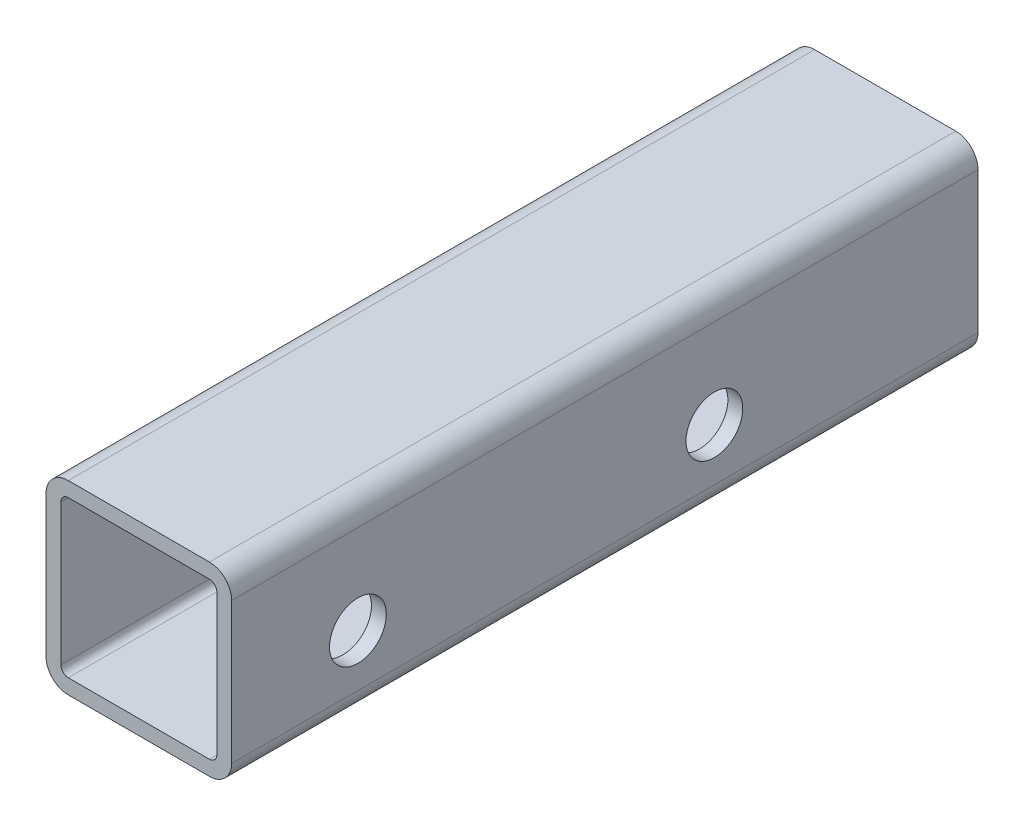
ISO-10303-21;
HEADER;
FILE_DESCRIPTION(('STEP AP214'),'2;1');
FILE_NAME('part.step','',(''),(''),'','','');
FILE_SCHEMA(('AUTOMOTIVE_DESIGN { 1 0 10303 214 1 1 1 1 }'));
ENDSEC;
DATA;
#1=APPLICATION_CONTEXT('core data for automotive mechanical design processes');
#2=APPLICATION_PROTOCOL_DEFINITION('international standard','automotive_design',2000,#1);
#3=PRODUCT_CONTEXT('',#1,'mechanical');
#4=PRODUCT('Part','Part','',(#3));
#5=PRODUCT_RELATED_PRODUCT_CATEGORY('part','',(#4));
#6=PRODUCT_DEFINITION_FORMATION('','',#4);
#7=PRODUCT_DEFINITION_CONTEXT('part definition',#1,'design');
#8=PRODUCT_DEFINITION('design','',#6,#7);
#9=PRODUCT_DEFINITION_SHAPE('','',#8);
#10=(LENGTH_UNIT() NAMED_UNIT(*) SI_UNIT(.MILLI.,.METRE.));
#11=(NAMED_UNIT(*) PLANE_ANGLE_UNIT() SI_UNIT($,.RADIAN.));
#12=(NAMED_UNIT(*) SI_UNIT($,.STERADIAN.) SOLID_ANGLE_UNIT());
#13=UNCERTAINTY_MEASURE_WITH_UNIT(LENGTH_MEASURE(1.E-05),#10,'distance_accuracy_value','');
#14=(GEOMETRIC_REPRESENTATION_CONTEXT(3) GLOBAL_UNCERTAINTY_ASSIGNED_CONTEXT((#13)) GLOBAL_UNIT_ASSIGNED_CONTEXT((#10,
#11,#12)) REPRESENTATION_CONTEXT('',''));
#15=CARTESIAN_POINT('',(0.,0.,0.));
#16=DIRECTION('',(0.,0.,1.));
#17=DIRECTION('',(1.,0.,0.));
#18=AXIS2_PLACEMENT_3D('',#15,#16,#17);
#19=CARTESIAN_POINT('',(-8.28226376370367E-12,-9.52127265918534E-12,100.500000000007));
#20=DIRECTION('',(0.,0.,1.));
#21=DIRECTION('',(0.,-1.,0.));
#22=AXIS2_PLACEMENT_3D('',#19,#20,#21);
#23=PLANE('',#22);
#24=DIRECTION('',(0.,1.,0.));
#25=VECTOR('',#24,1.);
#26=CARTESIAN_POINT('',(-12.5000000000083,-4.75000000000968,100.500000000007));
#27=LINE('',#26,#25);
#28=CARTESIAN_POINT('',(-12.5000000000083,-9.50000000000962,100.500000000007));
#29=VERTEX_POINT('',#28);
#30=CARTESIAN_POINT('',(-12.5000000000083,9.49999999999037,100.500000000007));
#31=VERTEX_POINT('',#30);
#32=EDGE_CURVE('E258',#29,#31,#27,.T.);
#33=ORIENTED_EDGE('',*,*,#32,.F.);
#34=CARTESIAN_POINT('',(-9.50000000000828,-9.50000000000955,100.500000000007));
#35=DIRECTION('',(0.,0.,-1.));
#36=DIRECTION('',(1.,0.,0.));
#37=AXIS2_PLACEMENT_3D('',#34,#35,#36);
#38=CIRCLE('',#37,3.);
#39=CARTESIAN_POINT('',(-9.50000000000827,-12.5000000000095,100.500000000007));
#40=VERTEX_POINT('',#39);
#41=EDGE_CURVE('E274',#40,#29,#38,.T.);
#42=ORIENTED_EDGE('',*,*,#41,.F.);
#43=DIRECTION('',(-1.,0.,0.));
#44=VECTOR('',#43,1.);
#45=CARTESIAN_POINT('',(4.74999999999172,-12.5000000000096,100.500000000007));
#46=LINE('',#45,#44);
#47=CARTESIAN_POINT('',(9.49999999999172,-12.5000000000095,100.500000000007));
#48=VERTEX_POINT('',#47);
#49=EDGE_CURVE('E236',#48,#40,#46,.T.);
#50=ORIENTED_EDGE('',*,*,#49,.F.);
#51=CARTESIAN_POINT('',(9.49999999999171,-9.50000000000955,100.500000000007));
#52=DIRECTION('',(0.,0.,-1.));
#53=DIRECTION('',(0.,1.,0.));
#54=AXIS2_PLACEMENT_3D('',#51,#52,#53);
#55=CIRCLE('',#54,3.);
#56=CARTESIAN_POINT('',(12.4999999999917,-9.50000000000955,100.500000000007));
#57=VERTEX_POINT('',#56);
#58=EDGE_CURVE('E299',#57,#48,#55,.T.);
#59=ORIENTED_EDGE('',*,*,#58,.F.);
#60=DIRECTION('',(0.,-1.,0.));
#61=VECTOR('',#60,1.);
#62=CARTESIAN_POINT('',(12.4999999999917,4.74999999999042,100.500000000007));
#63=LINE('',#62,#61);
#64=CARTESIAN_POINT('',(12.4999999999917,9.49999999999044,100.500000000007));
#65=VERTEX_POINT('',#64);
#66=EDGE_CURVE('E249',#65,#57,#63,.T.);
#67=ORIENTED_EDGE('',*,*,#66,.F.);
#68=CARTESIAN_POINT('',(9.49999999999172,9.49999999999051,100.500000000007));
#69=DIRECTION('',(0.,0.,-1.));
#70=DIRECTION('',(-1.,0.,0.));
#71=AXIS2_PLACEMENT_3D('',#68,#69,#70);
#72=CIRCLE('',#71,3.);
#73=CARTESIAN_POINT('',(9.49999999999172,12.4999999999905,100.500000000007));
#74=VERTEX_POINT('',#73);
#75=EDGE_CURVE('E26',#74,#65,#72,.T.);
#76=ORIENTED_EDGE('',*,*,#75,.F.);
#77=DIRECTION('',(1.,0.,0.));
#78=VECTOR('',#77,1.);
#79=CARTESIAN_POINT('',(-4.75000000000828,12.4999999999903,100.500000000007));
#80=LINE('',#79,#78);
#81=CARTESIAN_POINT('',(-9.50000000000828,12.4999999999905,100.500000000007));
#82=VERTEX_POINT('',#81);
#83=EDGE_CURVE('E330',#82,#74,#80,.T.);
#84=ORIENTED_EDGE('',*,*,#83,.F.);
#85=CARTESIAN_POINT('',(-9.50000000000828,9.49999999999051,100.500000000007));
#86=DIRECTION('',(0.,0.,-1.));
#87=DIRECTION('',(0.,-1.,0.));
#88=AXIS2_PLACEMENT_3D('',#85,#86,#87);
#89=CIRCLE('',#88,3.);
#90=EDGE_CURVE('E242',#31,#82,#89,.T.);
#91=ORIENTED_EDGE('',*,*,#90,.F.);
#92=EDGE_LOOP('',(#33,#42,#50,#59,#67,#76,#84,#91));
#93=FACE_BOUND('',#92,.T.);
#94=DIRECTION('',(-1.,0.,0.));
#95=VECTOR('',#94,1.);
#96=CARTESIAN_POINT('',(-4.75000000000828,10.4999999999905,100.500000000007));
#97=LINE('',#96,#95);
#98=CARTESIAN_POINT('',(9.49999999999172,10.4999999999905,100.500000000007));
#99=VERTEX_POINT('',#98);
#100=CARTESIAN_POINT('',(-9.50000000000828,10.4999999999905,100.500000000007));
#101=VERTEX_POINT('',#100);
#102=EDGE_CURVE('E254',#99,#101,#97,.T.);
#103=ORIENTED_EDGE('',*,*,#102,.F.);
#104=CARTESIAN_POINT('',(9.49999999999172,9.49999999999051,100.500000000007));
#105=DIRECTION('',(0.,0.,1.));
#106=DIRECTION('',(-1.,0.,0.));
#107=AXIS2_PLACEMENT_3D('',#104,#105,#106);
#108=CIRCLE('',#107,1.);
#109=CARTESIAN_POINT('',(10.4999999999917,9.49999999999051,100.500000000007));
#110=VERTEX_POINT('',#109);
#111=EDGE_CURVE('E227',#110,#99,#108,.T.);
#112=ORIENTED_EDGE('',*,*,#111,.F.);
#113=DIRECTION('',(0.,1.,0.));
#114=VECTOR('',#113,1.);
#115=CARTESIAN_POINT('',(10.4999999999917,4.74999999999049,100.500000000007));
#116=LINE('',#115,#114);
#117=CARTESIAN_POINT('',(10.4999999999917,-9.50000000000955,100.500000000007));
#118=VERTEX_POINT('',#117);
#119=EDGE_CURVE('E298',#118,#110,#116,.T.);
#120=ORIENTED_EDGE('',*,*,#119,.F.);
#121=CARTESIAN_POINT('',(9.49999999999171,-9.50000000000955,100.500000000007));
#122=DIRECTION('',(0.,0.,1.));
#123=DIRECTION('',(0.,1.,0.));
#124=AXIS2_PLACEMENT_3D('',#121,#122,#123);
#125=CIRCLE('',#124,1.);
#126=CARTESIAN_POINT('',(9.49999999999172,-10.5000000000095,100.500000000007));
#127=VERTEX_POINT('',#126);
#128=EDGE_CURVE('E264',#127,#118,#125,.T.);
#129=ORIENTED_EDGE('',*,*,#128,.F.);
#130=DIRECTION('',(1.,0.,0.));
#131=VECTOR('',#130,1.);
#132=CARTESIAN_POINT('',(4.74999999999172,-10.5000000000096,100.500000000007));
#133=LINE('',#132,#131);
#134=CARTESIAN_POINT('',(-9.50000000000828,-10.5000000000095,100.500000000007));
#135=VERTEX_POINT('',#134);
#136=EDGE_CURVE('E262',#135,#127,#133,.T.);
#137=ORIENTED_EDGE('',*,*,#136,.F.);
#138=CARTESIAN_POINT('',(-9.50000000000828,-9.50000000000955,100.500000000007));
#139=DIRECTION('',(0.,0.,1.));
#140=DIRECTION('',(1.,0.,0.));
#141=AXIS2_PLACEMENT_3D('',#138,#139,#140);
#142=CIRCLE('',#141,1.);
#143=CARTESIAN_POINT('',(-10.5000000000083,-9.50000000000955,100.500000000007));
#144=VERTEX_POINT('',#143);
#145=EDGE_CURVE('E210',#144,#135,#142,.T.);
#146=ORIENTED_EDGE('',*,*,#145,.F.);
#147=DIRECTION('',(0.,-1.,0.));
#148=VECTOR('',#147,1.);
#149=CARTESIAN_POINT('',(-10.5000000000083,-4.75000000000954,100.500000000007));
#150=LINE('',#149,#148);
#151=CARTESIAN_POINT('',(-10.5000000000083,9.49999999999051,100.500000000007));
#152=VERTEX_POINT('',#151);
#153=EDGE_CURVE('E195',#152,#144,#150,.T.);
#154=ORIENTED_EDGE('',*,*,#153,.F.);
#155=CARTESIAN_POINT('',(-9.50000000000828,9.49999999999051,100.500000000007));
#156=DIRECTION('',(0.,0.,1.));
#157=DIRECTION('',(0.,-1.,0.));
#158=AXIS2_PLACEMENT_3D('',#155,#156,#157);
#159=CIRCLE('',#158,1.);
#160=EDGE_CURVE('E307',#101,#152,#159,.T.);
#161=ORIENTED_EDGE('',*,*,#160,.F.);
#162=EDGE_LOOP('',(#103,#112,#120,#129,#137,#146,#154,#161));
#163=FACE_BOUND('',#162,.T.);
#164=ADVANCED_FACE('F16',(#93,#163),#23,.T.);
#165=CARTESIAN_POINT('',(-8.28226376370367E-12,-9.52127265918534E-12,7.38964445190504E-12));
#166=DIRECTION('',(0.,0.,1.));
#167=DIRECTION('',(0.,-1.,0.));
#168=AXIS2_PLACEMENT_3D('',#165,#166,#167);
#169=PLANE('',#168);
#170=DIRECTION('',(0.,1.,0.));
#171=VECTOR('',#170,1.);
#172=CARTESIAN_POINT('',(-12.5000000000083,-4.75000000000968,7.38964445190504E-12));
#173=LINE('',#172,#171);
#174=CARTESIAN_POINT('',(-12.5000000000083,-9.50000000000962,7.38964445190504E-12));
#175=VERTEX_POINT('',#174);
#176=CARTESIAN_POINT('',(-12.5000000000083,9.49999999999037,7.38964445190504E-12));
#177=VERTEX_POINT('',#176);
#178=EDGE_CURVE('E238',#175,#177,#173,.T.);
#179=ORIENTED_EDGE('',*,*,#178,.T.);
#180=CARTESIAN_POINT('',(-9.50000000000828,9.49999999999051,7.38964445190504E-12));
#181=DIRECTION('',(0.,0.,-1.));
#182=DIRECTION('',(0.,-1.,0.));
#183=AXIS2_PLACEMENT_3D('',#180,#181,#182);
#184=CIRCLE('',#183,3.);
#185=CARTESIAN_POINT('',(-9.50000000000828,12.4999999999905,7.38964445190504E-12));
#186=VERTEX_POINT('',#185);
#187=EDGE_CURVE('E289',#177,#186,#184,.T.);
#188=ORIENTED_EDGE('',*,*,#187,.T.);
#189=DIRECTION('',(1.,0.,0.));
#190=VECTOR('',#189,1.);
#191=CARTESIAN_POINT('',(-4.75000000000828,12.4999999999903,7.38964445190504E-12));
#192=LINE('',#191,#190);
#193=CARTESIAN_POINT('',(9.49999999999172,12.4999999999905,7.38964445190504E-12));
#194=VERTEX_POINT('',#193);
#195=EDGE_CURVE('E228',#186,#194,#192,.T.);
#196=ORIENTED_EDGE('',*,*,#195,.T.);
#197=CARTESIAN_POINT('',(9.49999999999172,9.49999999999051,7.38964445190504E-12));
#198=DIRECTION('',(0.,0.,-1.));
#199=DIRECTION('',(-1.,0.,0.));
#200=AXIS2_PLACEMENT_3D('',#197,#198,#199);
#201=CIRCLE('',#200,3.);
#202=CARTESIAN_POINT('',(12.4999999999917,9.49999999999044,7.38964445190504E-12));
#203=VERTEX_POINT('',#202);
#204=EDGE_CURVE('E11',#194,#203,#201,.T.);
#205=ORIENTED_EDGE('',*,*,#204,.T.);
#206=DIRECTION('',(0.,-1.,0.));
#207=VECTOR('',#206,1.);
#208=CARTESIAN_POINT('',(12.4999999999917,4.74999999999042,7.38964445190504E-12));
#209=LINE('',#208,#207);
#210=CARTESIAN_POINT('',(12.4999999999917,-9.50000000000955,7.38964445190504E-12));
#211=VERTEX_POINT('',#210);
#212=EDGE_CURVE('E248',#203,#211,#209,.T.);
#213=ORIENTED_EDGE('',*,*,#212,.T.);
#214=CARTESIAN_POINT('',(9.49999999999171,-9.50000000000955,7.38964445190504E-12));
#215=DIRECTION('',(0.,0.,-1.));
#216=DIRECTION('',(0.,1.,0.));
#217=AXIS2_PLACEMENT_3D('',#214,#215,#216);
#218=CIRCLE('',#217,3.);
#219=CARTESIAN_POINT('',(9.49999999999172,-12.5000000000095,7.38964445190504E-12));
#220=VERTEX_POINT('',#219);
#221=EDGE_CURVE('E232',#211,#220,#218,.T.);
#222=ORIENTED_EDGE('',*,*,#221,.T.);
#223=DIRECTION('',(-1.,0.,0.));
#224=VECTOR('',#223,1.);
#225=CARTESIAN_POINT('',(4.74999999999172,-12.5000000000096,7.38964445190504E-12));
#226=LINE('',#225,#224);
#227=CARTESIAN_POINT('',(-9.50000000000827,-12.5000000000095,7.38964445190504E-12));
#228=VERTEX_POINT('',#227);
#229=EDGE_CURVE('E290',#220,#228,#226,.T.);
#230=ORIENTED_EDGE('',*,*,#229,.T.);
#231=CARTESIAN_POINT('',(-9.50000000000828,-9.50000000000955,7.38964445190504E-12));
#232=DIRECTION('',(0.,0.,-1.));
#233=DIRECTION('',(1.,0.,0.));
#234=AXIS2_PLACEMENT_3D('',#231,#232,#233);
#235=CIRCLE('',#234,3.);
#236=EDGE_CURVE('E273',#228,#175,#235,.T.);
#237=ORIENTED_EDGE('',*,*,#236,.T.);
#238=EDGE_LOOP('',(#179,#188,#196,#205,#213,#222,#230,#237));
#239=FACE_BOUND('',#238,.T.);
#240=DIRECTION('',(-1.,0.,0.));
#241=VECTOR('',#240,1.);
#242=CARTESIAN_POINT('',(-4.75000000000828,10.4999999999905,7.38964445190504E-12));
#243=LINE('',#242,#241);
#244=CARTESIAN_POINT('',(9.49999999999172,10.4999999999905,7.38964445190504E-12));
#245=VERTEX_POINT('',#244);
#246=CARTESIAN_POINT('',(-9.50000000000829,10.4999999999905,7.38964445190504E-12));
#247=VERTEX_POINT('',#246);
#248=EDGE_CURVE('E216',#245,#247,#243,.T.);
#249=ORIENTED_EDGE('',*,*,#248,.T.);
#250=CARTESIAN_POINT('',(-9.50000000000828,9.49999999999051,7.38964445190504E-12));
#251=DIRECTION('',(0.,0.,1.));
#252=DIRECTION('',(0.,-1.,0.));
#253=AXIS2_PLACEMENT_3D('',#250,#251,#252);
#254=CIRCLE('',#253,1.);
#255=CARTESIAN_POINT('',(-10.5000000000083,9.49999999999051,7.38964445190504E-12));
#256=VERTEX_POINT('',#255);
#257=EDGE_CURVE('E190',#247,#256,#254,.T.);
#258=ORIENTED_EDGE('',*,*,#257,.T.);
#259=DIRECTION('',(0.,-1.,0.));
#260=VECTOR('',#259,1.);
#261=CARTESIAN_POINT('',(-10.5000000000083,-4.75000000000954,7.38964445190504E-12));
#262=LINE('',#261,#260);
#263=CARTESIAN_POINT('',(-10.5000000000083,-9.50000000000955,7.38964445190504E-12));
#264=VERTEX_POINT('',#263);
#265=EDGE_CURVE('E182',#256,#264,#262,.T.);
#266=ORIENTED_EDGE('',*,*,#265,.T.);
#267=CARTESIAN_POINT('',(-9.50000000000828,-9.50000000000955,7.38964445190504E-12));
#268=DIRECTION('',(0.,0.,1.));
#269=DIRECTION('',(1.,0.,0.));
#270=AXIS2_PLACEMENT_3D('',#267,#268,#269);
#271=CIRCLE('',#270,1.);
#272=CARTESIAN_POINT('',(-9.50000000000828,-10.5000000000095,7.38964445190504E-12));
#273=VERTEX_POINT('',#272);
#274=EDGE_CURVE('E188',#264,#273,#271,.T.);
#275=ORIENTED_EDGE('',*,*,#274,.T.);
#276=DIRECTION('',(1.,0.,0.));
#277=VECTOR('',#276,1.);
#278=CARTESIAN_POINT('',(4.74999999999172,-10.5000000000096,7.38964445190504E-12));
#279=LINE('',#278,#277);
#280=CARTESIAN_POINT('',(9.49999999999172,-10.5000000000095,7.38964445190504E-12));
#281=VERTEX_POINT('',#280);
#282=EDGE_CURVE('E281',#273,#281,#279,.T.);
#283=ORIENTED_EDGE('',*,*,#282,.T.);
#284=CARTESIAN_POINT('',(9.49999999999171,-9.50000000000955,7.38964445190504E-12));
#285=DIRECTION('',(0.,0.,1.));
#286=DIRECTION('',(0.,1.,0.));
#287=AXIS2_PLACEMENT_3D('',#284,#285,#286);
#288=CIRCLE('',#287,1.);
#289=CARTESIAN_POINT('',(10.4999999999917,-9.50000000000955,7.38964445190504E-12));
#290=VERTEX_POINT('',#289);
#291=EDGE_CURVE('E294',#281,#290,#288,.T.);
#292=ORIENTED_EDGE('',*,*,#291,.T.);
#293=DIRECTION('',(0.,1.,0.));
#294=VECTOR('',#293,1.);
#295=CARTESIAN_POINT('',(10.4999999999917,4.74999999999049,7.38964445190504E-12));
#296=LINE('',#295,#294);
#297=CARTESIAN_POINT('',(10.4999999999917,9.49999999999051,7.38964445190504E-12));
#298=VERTEX_POINT('',#297);
#299=EDGE_CURVE('E322',#290,#298,#296,.T.);
#300=ORIENTED_EDGE('',*,*,#299,.T.);
#301=CARTESIAN_POINT('',(9.49999999999172,9.49999999999051,7.38964445190504E-12));
#302=DIRECTION('',(0.,0.,1.));
#303=DIRECTION('',(-1.,0.,0.));
#304=AXIS2_PLACEMENT_3D('',#301,#302,#303);
#305=CIRCLE('',#304,1.);
#306=EDGE_CURVE('E226',#298,#245,#305,.T.);
#307=ORIENTED_EDGE('',*,*,#306,.T.);
#308=EDGE_LOOP('',(#249,#258,#266,#275,#283,#292,#300,#307));
#309=FACE_BOUND('',#308,.T.);
#310=ADVANCED_FACE('F185',(#239,#309),#169,.F.);
#311=CARTESIAN_POINT('',(9.49999999999172,9.49999999999051,7.38964445190504E-12));
#312=DIRECTION('',(0.,0.,1.));
#313=DIRECTION('',(-1.,0.,0.));
#314=AXIS2_PLACEMENT_3D('',#311,#312,#313);
#315=CYLINDRICAL_SURFACE('',#314,3.);
#316=ORIENTED_EDGE('',*,*,#75,.T.);
#317=DIRECTION('',(0.,0.,1.));
#318=VECTOR('',#317,1.);
#319=CARTESIAN_POINT('',(12.4999999999917,9.49999999999044,7.38964445190504E-12));
#320=LINE('',#319,#318);
#321=EDGE_CURVE('E303',#203,#65,#320,.T.);
#322=ORIENTED_EDGE('',*,*,#321,.F.);
#323=ORIENTED_EDGE('',*,*,#204,.F.);
#324=DIRECTION('',(0.,0.,1.));
#325=VECTOR('',#324,1.);
#326=CARTESIAN_POINT('',(9.49999999999172,12.4999999999905,7.38964445190504E-12));
#327=LINE('',#326,#325);
#328=EDGE_CURVE('E231',#194,#74,#327,.T.);
#329=ORIENTED_EDGE('',*,*,#328,.T.);
#330=EDGE_LOOP('',(#316,#322,#323,#329));
#331=FACE_BOUND('',#330,.T.);
#332=ADVANCED_FACE('F407',(#331),#315,.T.);
#333=CARTESIAN_POINT('',(-9.50000000000828,12.4999999999905,7.38964445190504E-12));
#334=DIRECTION('',(0.,1.,0.));
#335=DIRECTION('',(1.,0.,0.));
#336=AXIS2_PLACEMENT_3D('',#333,#334,#335);
#337=PLANE('',#336);
#338=ORIENTED_EDGE('',*,*,#83,.T.);
#339=ORIENTED_EDGE('',*,*,#328,.F.);
#340=ORIENTED_EDGE('',*,*,#195,.F.);
#341=DIRECTION('',(0.,0.,1.));
#342=VECTOR('',#341,1.);
#343=CARTESIAN_POINT('',(-9.50000000000828,12.4999999999905,7.38964445190504E-12));
#344=LINE('',#343,#342);
#345=EDGE_CURVE('E285',#186,#82,#344,.T.);
#346=ORIENTED_EDGE('',*,*,#345,.T.);
#347=EDGE_LOOP('',(#338,#339,#340,#346));
#348=FACE_BOUND('',#347,.T.);
#349=ADVANCED_FACE('F406',(#348),#337,.T.);
#350=CARTESIAN_POINT('',(-9.50000000000828,9.49999999999051,7.38964445190504E-12));
#351=DIRECTION('',(0.,0.,1.));
#352=DIRECTION('',(0.,-1.,0.));
#353=AXIS2_PLACEMENT_3D('',#350,#351,#352);
#354=CYLINDRICAL_SURFACE('',#353,3.);
#355=ORIENTED_EDGE('',*,*,#90,.T.);
#356=ORIENTED_EDGE('',*,*,#345,.F.);
#357=ORIENTED_EDGE('',*,*,#187,.F.);
#358=DIRECTION('',(0.,0.,1.));
#359=VECTOR('',#358,1.);
#360=CARTESIAN_POINT('',(-12.5000000000083,9.49999999999037,7.38964445190504E-12));
#361=LINE('',#360,#359);
#362=EDGE_CURVE('E243',#177,#31,#361,.T.);
#363=ORIENTED_EDGE('',*,*,#362,.T.);
#364=EDGE_LOOP('',(#355,#356,#357,#363));
#365=FACE_BOUND('',#364,.T.);
#366=ADVANCED_FACE('F415',(#365),#354,.T.);
#367=CARTESIAN_POINT('',(-12.5000000000083,-9.50000000000962,7.38964445190504E-12));
#368=DIRECTION('',(-1.,0.,0.));
#369=DIRECTION('',(0.,1.,0.));
#370=AXIS2_PLACEMENT_3D('',#367,#368,#369);
#371=PLANE('',#370);
#372=ORIENTED_EDGE('',*,*,#32,.T.);
#373=ORIENTED_EDGE('',*,*,#362,.F.);
#374=ORIENTED_EDGE('',*,*,#178,.F.);
#375=DIRECTION('',(0.,0.,1.));
#376=VECTOR('',#375,1.);
#377=CARTESIAN_POINT('',(-12.5000000000083,-9.50000000000962,7.38964445190504E-12));
#378=LINE('',#377,#376);
#379=EDGE_CURVE('E269',#175,#29,#378,.T.);
#380=ORIENTED_EDGE('',*,*,#379,.T.);
#381=EDGE_LOOP('',(#372,#373,#374,#380));
#382=FACE_BOUND('',#381,.T.);
#383=ADVANCED_FACE('F450',(#382),#371,.T.);
#384=CARTESIAN_POINT('',(-9.50000000000828,9.49999999999051,7.38964445190504E-12));
#385=DIRECTION('',(0.,0.,1.));
#386=DIRECTION('',(0.,-1.,0.));
#387=AXIS2_PLACEMENT_3D('',#384,#385,#386);
#388=CYLINDRICAL_SURFACE('',#387,1.);
#389=ORIENTED_EDGE('',*,*,#160,.T.);
#390=DIRECTION('',(0.,0.,1.));
#391=VECTOR('',#390,1.);
#392=CARTESIAN_POINT('',(-10.5000000000083,9.49999999999051,7.38964445190504E-12));
#393=LINE('',#392,#391);
#394=EDGE_CURVE('E20',#256,#152,#393,.T.);
#395=ORIENTED_EDGE('',*,*,#394,.F.);
#396=ORIENTED_EDGE('',*,*,#257,.F.);
#397=DIRECTION('',(0.,0.,1.));
#398=VECTOR('',#397,1.);
#399=CARTESIAN_POINT('',(-9.50000000000829,10.4999999999905,7.38964445190504E-12));
#400=LINE('',#399,#398);
#401=EDGE_CURVE('E250',#247,#101,#400,.T.);
#402=ORIENTED_EDGE('',*,*,#401,.T.);
#403=EDGE_LOOP('',(#389,#395,#396,#402));
#404=FACE_BOUND('',#403,.T.);
#405=ADVANCED_FACE('F531',(#404),#388,.F.);
#406=CARTESIAN_POINT('',(-10.5000000000083,-9.50000000000955,7.38964445190504E-12));
#407=DIRECTION('',(-1.,0.,0.));
#408=DIRECTION('',(0.,1.,0.));
#409=AXIS2_PLACEMENT_3D('',#406,#407,#408);
#410=PLANE('',#409);
#411=ORIENTED_EDGE('',*,*,#153,.T.);
#412=DIRECTION('',(0.,0.,1.));
#413=VECTOR('',#412,1.);
#414=CARTESIAN_POINT('',(-10.5000000000083,-9.50000000000955,7.38964445190504E-12));
#415=LINE('',#414,#413);
#416=EDGE_CURVE('E198',#264,#144,#415,.T.);
#417=ORIENTED_EDGE('',*,*,#416,.F.);
#418=ORIENTED_EDGE('',*,*,#265,.F.);
#419=ORIENTED_EDGE('',*,*,#394,.T.);
#420=EDGE_LOOP('',(#411,#417,#418,#419));
#421=FACE_BOUND('',#420,.T.);
#422=ADVANCED_FACE('F199',(#421),#410,.F.);
#423=CARTESIAN_POINT('',(-9.50000000000828,-9.50000000000955,7.38964445190504E-12));
#424=DIRECTION('',(0.,0.,1.));
#425=DIRECTION('',(1.,0.,0.));
#426=AXIS2_PLACEMENT_3D('',#423,#424,#425);
#427=CYLINDRICAL_SURFACE('',#426,1.);
#428=ORIENTED_EDGE('',*,*,#145,.T.);
#429=DIRECTION('',(0.,0.,1.));
#430=VECTOR('',#429,1.);
#431=CARTESIAN_POINT('',(-9.50000000000828,-10.5000000000095,7.38964445190504E-12));
#432=LINE('',#431,#430);
#433=EDGE_CURVE('E207',#273,#135,#432,.T.);
#434=ORIENTED_EDGE('',*,*,#433,.F.);
#435=ORIENTED_EDGE('',*,*,#274,.F.);
#436=ORIENTED_EDGE('',*,*,#416,.T.);
#437=EDGE_LOOP('',(#428,#434,#435,#436));
#438=FACE_BOUND('',#437,.T.);
#439=ADVANCED_FACE('F205',(#438),#427,.F.);
#440=CARTESIAN_POINT('',(-9.50000000000829,10.4999999999905,7.38964445190504E-12));
#441=DIRECTION('',(0.,1.,0.));
#442=DIRECTION('',(1.,0.,0.));
#443=AXIS2_PLACEMENT_3D('',#440,#441,#442);
#444=PLANE('',#443);
#445=ORIENTED_EDGE('',*,*,#102,.T.);
#446=ORIENTED_EDGE('',*,*,#401,.F.);
#447=ORIENTED_EDGE('',*,*,#248,.F.);
#448=DIRECTION('',(0.,0.,1.));
#449=VECTOR('',#448,1.);
#450=CARTESIAN_POINT('',(9.49999999999172,10.4999999999905,7.38964445190504E-12));
#451=LINE('',#450,#449);
#452=EDGE_CURVE('E222',#245,#99,#451,.T.);
#453=ORIENTED_EDGE('',*,*,#452,.T.);
#454=EDGE_LOOP('',(#445,#446,#447,#453));
#455=FACE_BOUND('',#454,.T.);
#456=ADVANCED_FACE('F434',(#455),#444,.F.);
#457=CARTESIAN_POINT('',(-9.50000000000828,-9.50000000000955,7.38964445190504E-12));
#458=DIRECTION('',(0.,0.,1.));
#459=DIRECTION('',(1.,0.,0.));
#460=AXIS2_PLACEMENT_3D('',#457,#458,#459);
#461=CYLINDRICAL_SURFACE('',#460,3.);
#462=ORIENTED_EDGE('',*,*,#41,.T.);
#463=ORIENTED_EDGE('',*,*,#379,.F.);
#464=ORIENTED_EDGE('',*,*,#236,.F.);
#465=DIRECTION('',(0.,0.,1.));
#466=VECTOR('',#465,1.);
#467=CARTESIAN_POINT('',(-9.50000000000827,-12.5000000000095,7.38964445190504E-12));
#468=LINE('',#467,#466);
#469=EDGE_CURVE('E220',#228,#40,#468,.T.);
#470=ORIENTED_EDGE('',*,*,#469,.T.);
#471=EDGE_LOOP('',(#462,#463,#464,#470));
#472=FACE_BOUND('',#471,.T.);
#473=ADVANCED_FACE('F431',(#472),#461,.T.);
#474=CARTESIAN_POINT('',(9.49999999999172,-12.5000000000095,7.38964445190504E-12));
#475=DIRECTION('',(0.,-1.,0.));
#476=DIRECTION('',(0.,0.,-1.));
#477=AXIS2_PLACEMENT_3D('',#474,#475,#476);
#478=PLANE('',#477);
#479=ORIENTED_EDGE('',*,*,#49,.T.);
#480=ORIENTED_EDGE('',*,*,#469,.F.);
#481=ORIENTED_EDGE('',*,*,#229,.F.);
#482=DIRECTION('',(0.,0.,1.));
#483=VECTOR('',#482,1.);
#484=CARTESIAN_POINT('',(9.49999999999172,-12.5000000000095,7.38964445190504E-12));
#485=LINE('',#484,#483);
#486=EDGE_CURVE('E237',#220,#48,#485,.T.);
#487=ORIENTED_EDGE('',*,*,#486,.T.);
#488=EDGE_LOOP('',(#479,#480,#481,#487));
#489=FACE_BOUND('',#488,.T.);
#490=ADVANCED_FACE('F433',(#489),#478,.T.);
#491=CARTESIAN_POINT('',(9.49999999999171,-9.50000000000955,7.38964445190504E-12));
#492=DIRECTION('',(0.,0.,1.));
#493=DIRECTION('',(0.,1.,0.));
#494=AXIS2_PLACEMENT_3D('',#491,#492,#493);
#495=CYLINDRICAL_SURFACE('',#494,3.);
#496=ORIENTED_EDGE('',*,*,#58,.T.);
#497=ORIENTED_EDGE('',*,*,#486,.F.);
#498=ORIENTED_EDGE('',*,*,#221,.F.);
#499=DIRECTION('',(0.,0.,1.));
#500=VECTOR('',#499,1.);
#501=CARTESIAN_POINT('',(12.4999999999917,-9.50000000000955,7.38964445190504E-12));
#502=LINE('',#501,#500);
#503=EDGE_CURVE('E244',#211,#57,#502,.T.);
#504=ORIENTED_EDGE('',*,*,#503,.T.);
#505=EDGE_LOOP('',(#496,#497,#498,#504));
#506=FACE_BOUND('',#505,.T.);
#507=ADVANCED_FACE('F401',(#506),#495,.T.);
#508=CARTESIAN_POINT('',(12.4999999999917,9.49999999999044,7.38964445190504E-12));
#509=DIRECTION('',(1.,0.,0.));
#510=DIRECTION('',(0.,1.,0.));
#511=AXIS2_PLACEMENT_3D('',#508,#509,#510);
#512=PLANE('',#511);
#513=ORIENTED_EDGE('',*,*,#66,.T.);
#514=ORIENTED_EDGE('',*,*,#503,.F.);
#515=ORIENTED_EDGE('',*,*,#212,.F.);
#516=ORIENTED_EDGE('',*,*,#321,.T.);
#517=EDGE_LOOP('',(#513,#514,#515,#516));
#518=FACE_BOUND('',#517,.T.);
#519=CARTESIAN_POINT('',(12.4999999999917,-2.50000000000824,83.5000000000069));
#520=DIRECTION('',(-1.,0.,0.));
#521=DIRECTION('',(0.,-1.,0.));
#522=AXIS2_PLACEMENT_3D('',#519,#520,#521);
#523=CIRCLE('',#522,3.8235);
#524=CARTESIAN_POINT('',(12.4999999999917,-6.32350000000827,83.5000000000069));
#525=VERTEX_POINT('',#524);
#526=EDGE_CURVE('E259',#525,#525,#523,.T.);
#527=ORIENTED_EDGE('',*,*,#526,.T.);
#528=EDGE_LOOP('',(#527));
#529=FACE_BOUND('',#528,.T.);
#530=CARTESIAN_POINT('',(12.4999999999917,-2.50000000000341,35.5000000000034));
#531=DIRECTION('',(-1.,0.,0.));
#532=DIRECTION('',(0.,-1.,0.));
#533=AXIS2_PLACEMENT_3D('',#530,#531,#532);
#534=CIRCLE('',#533,3.8235);
#535=CARTESIAN_POINT('',(12.4999999999917,-6.32350000000343,35.5000000000034));
#536=VERTEX_POINT('',#535);
#537=EDGE_CURVE('E310',#536,#536,#534,.T.);
#538=ORIENTED_EDGE('',*,*,#537,.T.);
#539=EDGE_LOOP('',(#538));
#540=FACE_BOUND('',#539,.T.);
#541=ADVANCED_FACE('F18',(#518,#529,#540),#512,.T.);
#542=CARTESIAN_POINT('',(9.49999999999172,9.49999999999051,7.38964445190504E-12));
#543=DIRECTION('',(0.,0.,1.));
#544=DIRECTION('',(-1.,0.,0.));
#545=AXIS2_PLACEMENT_3D('',#542,#543,#544);
#546=CYLINDRICAL_SURFACE('',#545,1.);
#547=ORIENTED_EDGE('',*,*,#111,.T.);
#548=ORIENTED_EDGE('',*,*,#452,.F.);
#549=ORIENTED_EDGE('',*,*,#306,.F.);
#550=DIRECTION('',(0.,0.,1.));
#551=VECTOR('',#550,1.);
#552=CARTESIAN_POINT('',(10.4999999999917,9.49999999999051,7.38964445190504E-12));
#553=LINE('',#552,#551);
#554=EDGE_CURVE('E326',#298,#110,#553,.T.);
#555=ORIENTED_EDGE('',*,*,#554,.T.);
#556=EDGE_LOOP('',(#547,#548,#549,#555));
#557=FACE_BOUND('',#556,.T.);
#558=ADVANCED_FACE('F426',(#557),#546,.F.);
#559=CARTESIAN_POINT('',(10.4999999999917,9.49999999999051,7.38964445190504E-12));
#560=DIRECTION('',(1.,0.,0.));
#561=DIRECTION('',(0.,-1.,0.));
#562=AXIS2_PLACEMENT_3D('',#559,#560,#561);
#563=PLANE('',#562);
#564=ORIENTED_EDGE('',*,*,#119,.T.);
#565=ORIENTED_EDGE('',*,*,#554,.F.);
#566=ORIENTED_EDGE('',*,*,#299,.F.);
#567=DIRECTION('',(0.,0.,1.));
#568=VECTOR('',#567,1.);
#569=CARTESIAN_POINT('',(10.4999999999917,-9.50000000000955,7.38964445190504E-12));
#570=LINE('',#569,#568);
#571=EDGE_CURVE('E268',#290,#118,#570,.T.);
#572=ORIENTED_EDGE('',*,*,#571,.T.);
#573=EDGE_LOOP('',(#564,#565,#566,#572));
#574=FACE_BOUND('',#573,.T.);
#575=CARTESIAN_POINT('',(10.4999999999917,-2.50000000000824,83.5000000000069));
#576=DIRECTION('',(1.,0.,0.));
#577=DIRECTION('',(0.,-1.,0.));
#578=AXIS2_PLACEMENT_3D('',#575,#576,#577);
#579=CIRCLE('',#578,3.8235);
#580=CARTESIAN_POINT('',(10.4999999999917,1.32349999999178,83.5000000000069));
#581=VERTEX_POINT('',#580);
#582=EDGE_CURVE('E263',#581,#581,#579,.T.);
#583=ORIENTED_EDGE('',*,*,#582,.T.);
#584=EDGE_LOOP('',(#583));
#585=FACE_BOUND('',#584,.T.);
#586=CARTESIAN_POINT('',(10.4999999999917,-2.50000000000341,35.5000000000034));
#587=DIRECTION('',(1.,0.,0.));
#588=DIRECTION('',(0.,-1.,0.));
#589=AXIS2_PLACEMENT_3D('',#586,#587,#588);
#590=CIRCLE('',#589,3.8235);
#591=CARTESIAN_POINT('',(10.4999999999917,1.32349999999661,35.5000000000034));
#592=VERTEX_POINT('',#591);
#593=EDGE_CURVE('E313',#592,#592,#590,.T.);
#594=ORIENTED_EDGE('',*,*,#593,.T.);
#595=EDGE_LOOP('',(#594));
#596=FACE_BOUND('',#595,.T.);
#597=ADVANCED_FACE('F375',(#574,#585,#596),#563,.F.);
#598=CARTESIAN_POINT('',(9.49999999999171,-9.50000000000955,7.38964445190504E-12));
#599=DIRECTION('',(0.,0.,1.));
#600=DIRECTION('',(0.,1.,0.));
#601=AXIS2_PLACEMENT_3D('',#598,#599,#600);
#602=CYLINDRICAL_SURFACE('',#601,1.);
#603=ORIENTED_EDGE('',*,*,#128,.T.);
#604=ORIENTED_EDGE('',*,*,#571,.F.);
#605=ORIENTED_EDGE('',*,*,#291,.F.);
#606=DIRECTION('',(0.,0.,1.));
#607=VECTOR('',#606,1.);
#608=CARTESIAN_POINT('',(9.49999999999172,-10.5000000000095,7.38964445190504E-12));
#609=LINE('',#608,#607);
#610=EDGE_CURVE('E278',#281,#127,#609,.T.);
#611=ORIENTED_EDGE('',*,*,#610,.T.);
#612=EDGE_LOOP('',(#603,#604,#605,#611));
#613=FACE_BOUND('',#612,.T.);
#614=ADVANCED_FACE('F379',(#613),#602,.F.);
#615=CARTESIAN_POINT('',(9.49999999999172,-10.5000000000095,7.38964445190504E-12));
#616=DIRECTION('',(0.,-1.,0.));
#617=DIRECTION('',(0.,0.,-1.));
#618=AXIS2_PLACEMENT_3D('',#615,#616,#617);
#619=PLANE('',#618);
#620=ORIENTED_EDGE('',*,*,#136,.T.);
#621=ORIENTED_EDGE('',*,*,#610,.F.);
#622=ORIENTED_EDGE('',*,*,#282,.F.);
#623=ORIENTED_EDGE('',*,*,#433,.T.);
#624=EDGE_LOOP('',(#620,#621,#622,#623));
#625=FACE_BOUND('',#624,.T.);
#626=ADVANCED_FACE('F555',(#625),#619,.F.);
#627=CARTESIAN_POINT('',(8.49999999999172,-2.50000000000824,83.5000000000069));
#628=DIRECTION('',(1.,0.,0.));
#629=DIRECTION('',(0.,-1.,0.));
#630=AXIS2_PLACEMENT_3D('',#627,#628,#629);
#631=CYLINDRICAL_SURFACE('',#630,3.8235);
#632=ORIENTED_EDGE('',*,*,#526,.F.);
#633=EDGE_LOOP('',(#632));
#634=FACE_BOUND('',#633,.T.);
#635=ORIENTED_EDGE('',*,*,#582,.F.);
#636=EDGE_LOOP('',(#635));
#637=FACE_BOUND('',#636,.T.);
#638=ADVANCED_FACE('F549',(#634,#637),#631,.F.);
#639=CARTESIAN_POINT('',(8.49999999999172,-2.50000000000341,35.5000000000034));
#640=DIRECTION('',(1.,0.,0.));
#641=DIRECTION('',(0.,-1.,0.));
#642=AXIS2_PLACEMENT_3D('',#639,#640,#641);
#643=CYLINDRICAL_SURFACE('',#642,3.8235);
#644=ORIENTED_EDGE('',*,*,#537,.F.);
#645=EDGE_LOOP('',(#644));
#646=FACE_BOUND('',#645,.T.);
#647=ORIENTED_EDGE('',*,*,#593,.F.);
#648=EDGE_LOOP('',(#647));
#649=FACE_BOUND('',#648,.T.);
#650=ADVANCED_FACE('F544',(#646,#649),#643,.F.);
#651=CLOSED_SHELL('',(#164,#310,#332,#349,#366,#383,#405,#422,#439,#456,#473,#490,#507,#541,
#558,#597,#614,#626,#638,#650));
#652=MANIFOLD_SOLID_BREP('B1',#651);
#653=ADVANCED_BREP_SHAPE_REPRESENTATION('',(#18,#652),#14);
#654=SHAPE_DEFINITION_REPRESENTATION(#9,#653);
ENDSEC;
END-ISO-10303-21;
